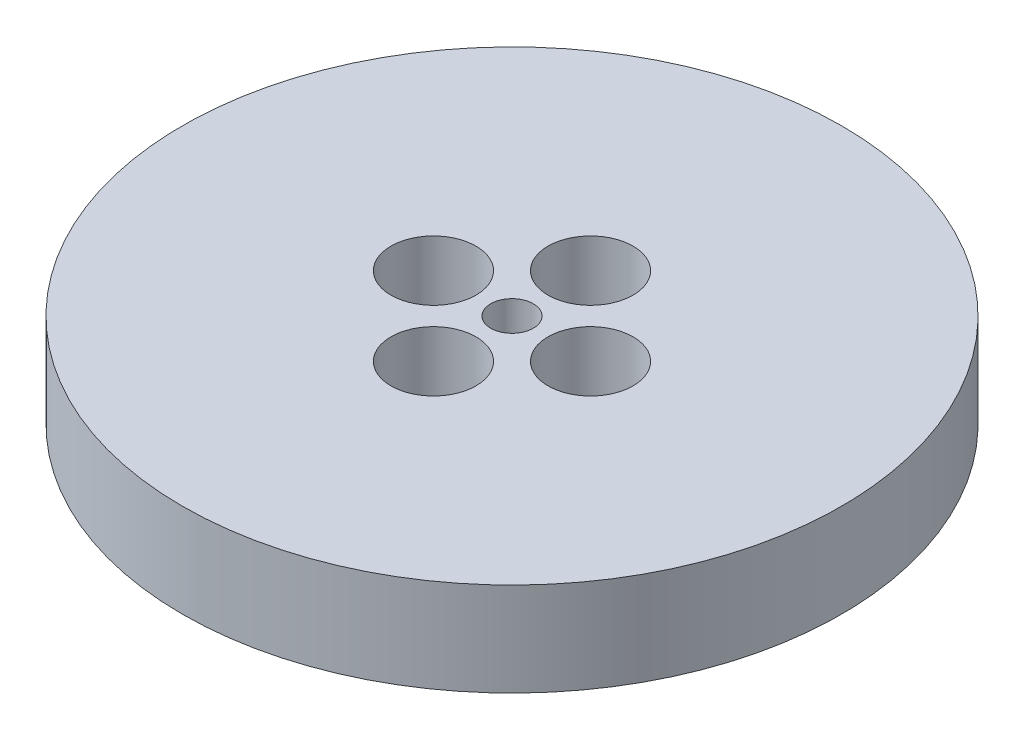
ISO-10303-21;
HEADER;
FILE_DESCRIPTION(('STEP AP214'),'2;1');
FILE_NAME('part.step','',(''),(''),'','','');
FILE_SCHEMA(('AUTOMOTIVE_DESIGN { 1 0 10303 214 1 1 1 1 }'));
ENDSEC;
DATA;
#1=APPLICATION_CONTEXT('core data for automotive mechanical design processes');
#2=APPLICATION_PROTOCOL_DEFINITION('international standard','automotive_design',2000,#1);
#3=PRODUCT_CONTEXT('',#1,'mechanical');
#4=PRODUCT('Part','Part','',(#3));
#5=PRODUCT_RELATED_PRODUCT_CATEGORY('part','',(#4));
#6=PRODUCT_DEFINITION_FORMATION('','',#4);
#7=PRODUCT_DEFINITION_CONTEXT('part definition',#1,'design');
#8=PRODUCT_DEFINITION('design','',#6,#7);
#9=PRODUCT_DEFINITION_SHAPE('','',#8);
#10=(LENGTH_UNIT() NAMED_UNIT(*) SI_UNIT(.MILLI.,.METRE.));
#11=(NAMED_UNIT(*) PLANE_ANGLE_UNIT() SI_UNIT($,.RADIAN.));
#12=(NAMED_UNIT(*) SI_UNIT($,.STERADIAN.) SOLID_ANGLE_UNIT());
#13=UNCERTAINTY_MEASURE_WITH_UNIT(LENGTH_MEASURE(1.E-05),#10,'distance_accuracy_value','');
#14=(GEOMETRIC_REPRESENTATION_CONTEXT(3) GLOBAL_UNCERTAINTY_ASSIGNED_CONTEXT((#13)) GLOBAL_UNIT_ASSIGNED_CONTEXT((#10,
#11,#12)) REPRESENTATION_CONTEXT('',''));
#15=CARTESIAN_POINT('',(0.,0.,0.));
#16=DIRECTION('',(0.,0.,1.));
#17=DIRECTION('',(1.,0.,0.));
#18=AXIS2_PLACEMENT_3D('',#15,#16,#17);
#19=CARTESIAN_POINT('',(0.,22.,0.));
#20=DIRECTION('',(0.,-1.,0.));
#21=DIRECTION('',(0.,0.,-1.));
#22=AXIS2_PLACEMENT_3D('',#19,#20,#21);
#23=CYLINDRICAL_SURFACE('',#22,77.5);
#24=CARTESIAN_POINT('',(0.,22.,0.));
#25=DIRECTION('',(0.,1.,0.));
#26=DIRECTION('',(0.,0.,1.));
#27=AXIS2_PLACEMENT_3D('',#24,#25,#26);
#28=CIRCLE('',#27,77.5);
#29=CARTESIAN_POINT('',(0.,22.,77.5));
#30=VERTEX_POINT('',#29);
#31=EDGE_CURVE('E10',#30,#30,#28,.T.);
#32=ORIENTED_EDGE('',*,*,#31,.F.);
#33=EDGE_LOOP('',(#32));
#34=FACE_BOUND('',#33,.T.);
#35=CARTESIAN_POINT('',(0.,0.,0.));
#36=DIRECTION('',(0.,1.,0.));
#37=DIRECTION('',(0.,0.,1.));
#38=AXIS2_PLACEMENT_3D('',#35,#36,#37);
#39=CIRCLE('',#38,77.5);
#40=CARTESIAN_POINT('',(0.,0.,77.5));
#41=VERTEX_POINT('',#40);
#42=EDGE_CURVE('E37',#41,#41,#39,.T.);
#43=ORIENTED_EDGE('',*,*,#42,.T.);
#44=EDGE_LOOP('',(#43));
#45=FACE_BOUND('',#44,.T.);
#46=ADVANCED_FACE('F40',(#34,#45),#23,.T.);
#47=CARTESIAN_POINT('',(0.,22.,0.));
#48=DIRECTION('',(0.,1.,0.));
#49=DIRECTION('',(0.,0.,1.));
#50=AXIS2_PLACEMENT_3D('',#47,#48,#49);
#51=PLANE('',#50);
#52=CARTESIAN_POINT('',(18.4701661182551,22.,0.));
#53=DIRECTION('',(0.,1.,0.));
#54=DIRECTION('',(0.,0.,-1.));
#55=AXIS2_PLACEMENT_3D('',#52,#53,#54);
#56=CIRCLE('',#55,10.);
#57=CARTESIAN_POINT('',(18.4701661182551,22.,-10.));
#58=VERTEX_POINT('',#57);
#59=EDGE_CURVE('E70',#58,#58,#56,.T.);
#60=ORIENTED_EDGE('',*,*,#59,.F.);
#61=EDGE_LOOP('',(#60));
#62=FACE_BOUND('',#61,.T.);
#63=CARTESIAN_POINT('',(-1.93464720981661E-13,22.,-18.4701661182551));
#64=DIRECTION('',(0.,1.,0.));
#65=DIRECTION('',(-1.,0.,0.));
#66=AXIS2_PLACEMENT_3D('',#63,#64,#65);
#67=CIRCLE('',#66,10.);
#68=CARTESIAN_POINT('',(-10.0000000000002,22.,-18.470166118255));
#69=VERTEX_POINT('',#68);
#70=EDGE_CURVE('E71',#69,#69,#67,.T.);
#71=ORIENTED_EDGE('',*,*,#70,.F.);
#72=EDGE_LOOP('',(#71));
#73=FACE_BOUND('',#72,.T.);
#74=CARTESIAN_POINT('',(0.,22.,18.4701661182551));
#75=DIRECTION('',(0.,1.,0.));
#76=DIRECTION('',(1.,0.,0.));
#77=AXIS2_PLACEMENT_3D('',#74,#75,#76);
#78=CIRCLE('',#77,10.);
#79=CARTESIAN_POINT('',(10.0000000000001,22.,18.470166118255));
#80=VERTEX_POINT('',#79);
#81=EDGE_CURVE('E61',#80,#80,#78,.T.);
#82=ORIENTED_EDGE('',*,*,#81,.F.);
#83=EDGE_LOOP('',(#82));
#84=FACE_BOUND('',#83,.T.);
#85=CARTESIAN_POINT('',(-18.4701661182551,22.,0.));
#86=DIRECTION('',(0.,1.,0.));
#87=DIRECTION('',(0.,0.,1.));
#88=AXIS2_PLACEMENT_3D('',#85,#86,#87);
#89=CIRCLE('',#88,10.);
#90=CARTESIAN_POINT('',(-18.4701661182551,22.,10.));
#91=VERTEX_POINT('',#90);
#92=EDGE_CURVE('E54',#91,#91,#89,.T.);
#93=ORIENTED_EDGE('',*,*,#92,.F.);
#94=EDGE_LOOP('',(#93));
#95=FACE_BOUND('',#94,.T.);
#96=CARTESIAN_POINT('',(0.,22.,0.));
#97=DIRECTION('',(0.,1.,0.));
#98=DIRECTION('',(0.,0.,1.));
#99=AXIS2_PLACEMENT_3D('',#96,#97,#98);
#100=CIRCLE('',#99,5.);
#101=CARTESIAN_POINT('',(0.,22.,5.));
#102=VERTEX_POINT('',#101);
#103=EDGE_CURVE('E50',#102,#102,#100,.T.);
#104=ORIENTED_EDGE('',*,*,#103,.F.);
#105=EDGE_LOOP('',(#104));
#106=FACE_BOUND('',#105,.T.);
#107=ORIENTED_EDGE('',*,*,#31,.T.);
#108=EDGE_LOOP('',(#107));
#109=FACE_BOUND('',#108,.T.);
#110=ADVANCED_FACE('F86',(#62,#73,#84,#95,#106,#109),#51,.T.);
#111=CARTESIAN_POINT('',(0.,0.,0.));
#112=DIRECTION('',(0.,1.,0.));
#113=DIRECTION('',(0.,0.,1.));
#114=AXIS2_PLACEMENT_3D('',#111,#112,#113);
#115=PLANE('',#114);
#116=CARTESIAN_POINT('',(0.,0.,0.));
#117=DIRECTION('',(0.,1.,0.));
#118=DIRECTION('',(0.,0.,1.));
#119=AXIS2_PLACEMENT_3D('',#116,#117,#118);
#120=CIRCLE('',#119,5.);
#121=CARTESIAN_POINT('',(0.,0.,5.));
#122=VERTEX_POINT('',#121);
#123=EDGE_CURVE('E47',#122,#122,#120,.T.);
#124=ORIENTED_EDGE('',*,*,#123,.T.);
#125=EDGE_LOOP('',(#124));
#126=FACE_BOUND('',#125,.T.);
#127=ORIENTED_EDGE('',*,*,#42,.F.);
#128=EDGE_LOOP('',(#127));
#129=FACE_BOUND('',#128,.T.);
#130=ADVANCED_FACE('F93',(#126,#129),#115,.F.);
#131=CARTESIAN_POINT('',(0.,22.,0.));
#132=DIRECTION('',(0.,-1.,0.));
#133=DIRECTION('',(0.,0.,-1.));
#134=AXIS2_PLACEMENT_3D('',#131,#132,#133);
#135=CYLINDRICAL_SURFACE('',#134,5.);
#136=ORIENTED_EDGE('',*,*,#103,.T.);
#137=EDGE_LOOP('',(#136));
#138=FACE_BOUND('',#137,.T.);
#139=ORIENTED_EDGE('',*,*,#123,.F.);
#140=EDGE_LOOP('',(#139));
#141=FACE_BOUND('',#140,.T.);
#142=ADVANCED_FACE('F99',(#138,#141),#135,.F.);
#143=CARTESIAN_POINT('',(-18.4701661182551,5.42891794519335,0.));
#144=DIRECTION('',(0.,1.,0.));
#145=DIRECTION('',(0.,0.,1.));
#146=AXIS2_PLACEMENT_3D('',#143,#144,#145);
#147=CYLINDRICAL_SURFACE('',#146,10.);
#148=CARTESIAN_POINT('',(-18.4701661182551,5.42891794519335,0.));
#149=DIRECTION('',(0.,1.,0.));
#150=DIRECTION('',(0.,0.,1.));
#151=AXIS2_PLACEMENT_3D('',#148,#149,#150);
#152=CIRCLE('',#151,10.);
#153=CARTESIAN_POINT('',(-18.4701661182551,5.42891794519335,10.));
#154=VERTEX_POINT('',#153);
#155=EDGE_CURVE('E55',#154,#154,#152,.T.);
#156=ORIENTED_EDGE('',*,*,#155,.F.);
#157=EDGE_LOOP('',(#156));
#158=FACE_BOUND('',#157,.T.);
#159=ORIENTED_EDGE('',*,*,#92,.T.);
#160=EDGE_LOOP('',(#159));
#161=FACE_BOUND('',#160,.T.);
#162=ADVANCED_FACE('F103',(#158,#161),#147,.F.);
#163=CARTESIAN_POINT('',(-18.4701661182551,5.42891794519335,0.));
#164=DIRECTION('',(0.,1.,0.));
#165=DIRECTION('',(0.,0.,1.));
#166=AXIS2_PLACEMENT_3D('',#163,#164,#165);
#167=PLANE('',#166);
#168=ORIENTED_EDGE('',*,*,#155,.T.);
#169=EDGE_LOOP('',(#168));
#170=FACE_BOUND('',#169,.T.);
#171=ADVANCED_FACE('F132',(#170),#167,.T.);
#172=CARTESIAN_POINT('',(0.,5.42891794519335,18.4701661182551));
#173=DIRECTION('',(0.,1.,0.));
#174=DIRECTION('',(0.,0.,1.));
#175=AXIS2_PLACEMENT_3D('',#172,#173,#174);
#176=CYLINDRICAL_SURFACE('',#175,10.);
#177=CARTESIAN_POINT('',(0.,5.42891794519335,18.4701661182551));
#178=DIRECTION('',(0.,1.,0.));
#179=DIRECTION('',(1.,0.,0.));
#180=AXIS2_PLACEMENT_3D('',#177,#178,#179);
#181=CIRCLE('',#180,10.);
#182=CARTESIAN_POINT('',(10.0000000000001,5.42891794519335,18.470166118255));
#183=VERTEX_POINT('',#182);
#184=EDGE_CURVE('E59',#183,#183,#181,.T.);
#185=ORIENTED_EDGE('',*,*,#184,.F.);
#186=EDGE_LOOP('',(#185));
#187=FACE_BOUND('',#186,.T.);
#188=ORIENTED_EDGE('',*,*,#81,.T.);
#189=EDGE_LOOP('',(#188));
#190=FACE_BOUND('',#189,.T.);
#191=ADVANCED_FACE('F143',(#187,#190),#176,.F.);
#192=CARTESIAN_POINT('',(0.,5.42891794519335,18.4701661182551));
#193=DIRECTION('',(0.,1.,0.));
#194=DIRECTION('',(1.,0.,0.));
#195=AXIS2_PLACEMENT_3D('',#192,#193,#194);
#196=PLANE('',#195);
#197=ORIENTED_EDGE('',*,*,#184,.T.);
#198=EDGE_LOOP('',(#197));
#199=FACE_BOUND('',#198,.T.);
#200=ADVANCED_FACE('F83',(#199),#196,.T.);
#201=CARTESIAN_POINT('',(-1.93464720981661E-13,5.42891794519335,-18.4701661182551));
#202=DIRECTION('',(0.,1.,0.));
#203=DIRECTION('',(0.,0.,1.));
#204=AXIS2_PLACEMENT_3D('',#201,#202,#203);
#205=CYLINDRICAL_SURFACE('',#204,10.);
#206=CARTESIAN_POINT('',(-1.93464720981661E-13,5.42891794519335,-18.4701661182551));
#207=DIRECTION('',(0.,1.,0.));
#208=DIRECTION('',(-1.,0.,0.));
#209=AXIS2_PLACEMENT_3D('',#206,#207,#208);
#210=CIRCLE('',#209,10.);
#211=CARTESIAN_POINT('',(-10.0000000000002,5.42891794519335,-18.470166118255));
#212=VERTEX_POINT('',#211);
#213=EDGE_CURVE('E69',#212,#212,#210,.T.);
#214=ORIENTED_EDGE('',*,*,#213,.F.);
#215=EDGE_LOOP('',(#214));
#216=FACE_BOUND('',#215,.T.);
#217=ORIENTED_EDGE('',*,*,#70,.T.);
#218=EDGE_LOOP('',(#217));
#219=FACE_BOUND('',#218,.T.);
#220=ADVANCED_FACE('F81',(#216,#219),#205,.F.);
#221=CARTESIAN_POINT('',(-1.93464720981661E-13,5.42891794519335,-18.4701661182551));
#222=DIRECTION('',(0.,1.,0.));
#223=DIRECTION('',(-1.,0.,0.));
#224=AXIS2_PLACEMENT_3D('',#221,#222,#223);
#225=PLANE('',#224);
#226=ORIENTED_EDGE('',*,*,#213,.T.);
#227=EDGE_LOOP('',(#226));
#228=FACE_BOUND('',#227,.T.);
#229=ADVANCED_FACE('F78',(#228),#225,.T.);
#230=CARTESIAN_POINT('',(18.4701661182551,5.42891794519335,0.));
#231=DIRECTION('',(0.,1.,0.));
#232=DIRECTION('',(0.,0.,1.));
#233=AXIS2_PLACEMENT_3D('',#230,#231,#232);
#234=CYLINDRICAL_SURFACE('',#233,10.);
#235=CARTESIAN_POINT('',(18.4701661182551,5.42891794519335,0.));
#236=DIRECTION('',(0.,1.,0.));
#237=DIRECTION('',(0.,0.,-1.));
#238=AXIS2_PLACEMENT_3D('',#235,#236,#237);
#239=CIRCLE('',#238,10.);
#240=CARTESIAN_POINT('',(18.4701661182551,5.42891794519335,-10.));
#241=VERTEX_POINT('',#240);
#242=EDGE_CURVE('E63',#241,#241,#239,.T.);
#243=ORIENTED_EDGE('',*,*,#242,.F.);
#244=EDGE_LOOP('',(#243));
#245=FACE_BOUND('',#244,.T.);
#246=ORIENTED_EDGE('',*,*,#59,.T.);
#247=EDGE_LOOP('',(#246));
#248=FACE_BOUND('',#247,.T.);
#249=ADVANCED_FACE('F176',(#245,#248),#234,.F.);
#250=CARTESIAN_POINT('',(18.4701661182551,5.42891794519335,0.));
#251=DIRECTION('',(0.,1.,0.));
#252=DIRECTION('',(0.,0.,-1.));
#253=AXIS2_PLACEMENT_3D('',#250,#251,#252);
#254=PLANE('',#253);
#255=ORIENTED_EDGE('',*,*,#242,.T.);
#256=EDGE_LOOP('',(#255));
#257=FACE_BOUND('',#256,.T.);
#258=ADVANCED_FACE('F184',(#257),#254,.T.);
#259=CLOSED_SHELL('',(#46,#110,#130,#142,#162,#171,#191,#200,#220,#229,#249,#258));
#260=MANIFOLD_SOLID_BREP('B2',#259);
#261=ADVANCED_BREP_SHAPE_REPRESENTATION('',(#18,#260),#14);
#262=SHAPE_DEFINITION_REPRESENTATION(#9,#261);
ENDSEC;
END-ISO-10303-21;
